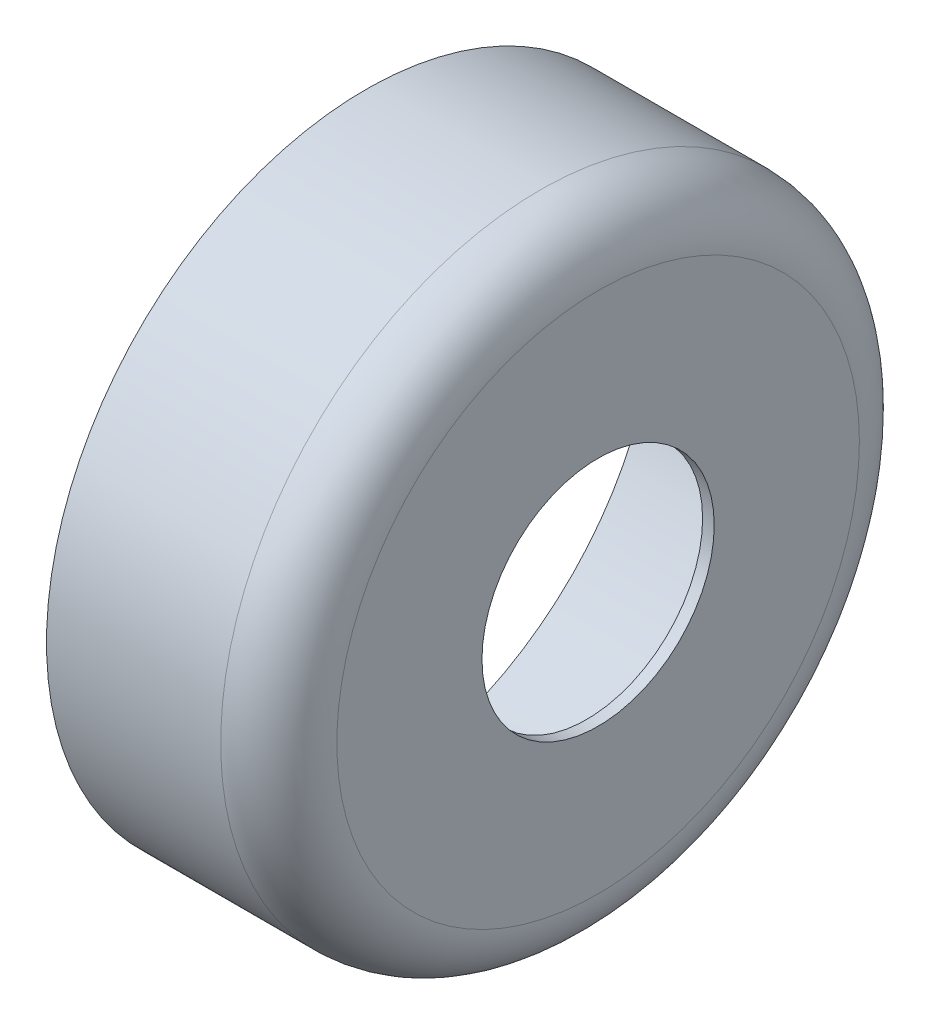
ISO-10303-21;
HEADER;
FILE_DESCRIPTION(('STEP AP214'),'2;1');
FILE_NAME('part.step','',(''),(''),'','','');
FILE_SCHEMA(('AUTOMOTIVE_DESIGN { 1 0 10303 214 1 1 1 1 }'));
ENDSEC;
DATA;
#1=APPLICATION_CONTEXT('core data for automotive mechanical design processes');
#2=APPLICATION_PROTOCOL_DEFINITION('international standard','automotive_design',2000,#1);
#3=PRODUCT_CONTEXT('',#1,'mechanical');
#4=PRODUCT('Part','Part','',(#3));
#5=PRODUCT_RELATED_PRODUCT_CATEGORY('part','',(#4));
#6=PRODUCT_DEFINITION_FORMATION('','',#4);
#7=PRODUCT_DEFINITION_CONTEXT('part definition',#1,'design');
#8=PRODUCT_DEFINITION('design','',#6,#7);
#9=PRODUCT_DEFINITION_SHAPE('','',#8);
#10=(LENGTH_UNIT() NAMED_UNIT(*) SI_UNIT(.MILLI.,.METRE.));
#11=(NAMED_UNIT(*) PLANE_ANGLE_UNIT() SI_UNIT($,.RADIAN.));
#12=(NAMED_UNIT(*) SI_UNIT($,.STERADIAN.) SOLID_ANGLE_UNIT());
#13=UNCERTAINTY_MEASURE_WITH_UNIT(LENGTH_MEASURE(1.E-05),#10,'distance_accuracy_value','');
#14=(GEOMETRIC_REPRESENTATION_CONTEXT(3) GLOBAL_UNCERTAINTY_ASSIGNED_CONTEXT((#13)) GLOBAL_UNIT_ASSIGNED_CONTEXT((#10,
#11,#12)) REPRESENTATION_CONTEXT('',''));
#15=CARTESIAN_POINT('',(0.,0.,0.));
#16=DIRECTION('',(0.,0.,1.));
#17=DIRECTION('',(1.,0.,0.));
#18=AXIS2_PLACEMENT_3D('',#15,#16,#17);
#19=CARTESIAN_POINT('',(40.,0.,0.));
#20=DIRECTION('',(-1.,0.,0.));
#21=DIRECTION('',(0.,0.,1.));
#22=AXIS2_PLACEMENT_3D('',#19,#20,#21);
#23=CYLINDRICAL_SURFACE('',#22,55.);
#24=CARTESIAN_POINT('',(30.,0.,0.));
#25=DIRECTION('',(1.,0.,0.));
#26=DIRECTION('',(0.,0.,-1.));
#27=AXIS2_PLACEMENT_3D('',#24,#25,#26);
#28=CIRCLE('',#27,55.);
#29=CARTESIAN_POINT('',(30.,0.,-55.));
#30=VERTEX_POINT('',#29);
#31=EDGE_CURVE('E10',#30,#30,#28,.F.);
#32=ORIENTED_EDGE('',*,*,#31,.T.);
#33=EDGE_LOOP('',(#32));
#34=FACE_BOUND('',#33,.T.);
#35=CARTESIAN_POINT('',(0.,0.,0.));
#36=DIRECTION('',(1.,0.,0.));
#37=DIRECTION('',(0.,0.,-1.));
#38=AXIS2_PLACEMENT_3D('',#35,#36,#37);
#39=CIRCLE('',#38,55.);
#40=CARTESIAN_POINT('',(0.,0.,-55.));
#41=VERTEX_POINT('',#40);
#42=EDGE_CURVE('E52',#41,#41,#39,.T.);
#43=ORIENTED_EDGE('',*,*,#42,.T.);
#44=EDGE_LOOP('',(#43));
#45=FACE_BOUND('',#44,.T.);
#46=ADVANCED_FACE('F39',(#34,#45),#23,.T.);
#47=CARTESIAN_POINT('',(40.,0.,0.));
#48=DIRECTION('',(1.,0.,0.));
#49=DIRECTION('',(0.,0.,-1.));
#50=AXIS2_PLACEMENT_3D('',#47,#48,#49);
#51=PLANE('',#50);
#52=CARTESIAN_POINT('',(40.,0.,0.));
#53=DIRECTION('',(1.,0.,0.));
#54=DIRECTION('',(0.,0.,-1.));
#55=AXIS2_PLACEMENT_3D('',#52,#53,#54);
#56=CIRCLE('',#55,45.);
#57=CARTESIAN_POINT('',(40.,0.,-45.));
#58=VERTEX_POINT('',#57);
#59=EDGE_CURVE('E47',#58,#58,#56,.T.);
#60=ORIENTED_EDGE('',*,*,#59,.T.);
#61=EDGE_LOOP('',(#60));
#62=FACE_BOUND('',#61,.T.);
#63=CARTESIAN_POINT('',(40.,0.,0.));
#64=DIRECTION('',(1.,0.,0.));
#65=DIRECTION('',(0.,0.,-1.));
#66=AXIS2_PLACEMENT_3D('',#63,#64,#65);
#67=CIRCLE('',#66,20.);
#68=CARTESIAN_POINT('',(40.,0.,-20.));
#69=VERTEX_POINT('',#68);
#70=EDGE_CURVE('E64',#69,#69,#67,.T.);
#71=ORIENTED_EDGE('',*,*,#70,.F.);
#72=EDGE_LOOP('',(#71));
#73=FACE_BOUND('',#72,.T.);
#74=ADVANCED_FACE('F78',(#62,#73),#51,.T.);
#75=CARTESIAN_POINT('',(0.,0.,0.));
#76=DIRECTION('',(1.,0.,0.));
#77=DIRECTION('',(0.,0.,-1.));
#78=AXIS2_PLACEMENT_3D('',#75,#76,#77);
#79=PLANE('',#78);
#80=CARTESIAN_POINT('',(0.,0.,0.));
#81=DIRECTION('',(-1.,0.,0.));
#82=DIRECTION('',(0.,0.,1.));
#83=AXIS2_PLACEMENT_3D('',#80,#81,#82);
#84=CIRCLE('',#83,50.);
#85=CARTESIAN_POINT('',(0.,0.,50.));
#86=VERTEX_POINT('',#85);
#87=EDGE_CURVE('E63',#86,#86,#84,.T.);
#88=ORIENTED_EDGE('',*,*,#87,.F.);
#89=EDGE_LOOP('',(#88));
#90=FACE_BOUND('',#89,.T.);
#91=ORIENTED_EDGE('',*,*,#42,.F.);
#92=EDGE_LOOP('',(#91));
#93=FACE_BOUND('',#92,.T.);
#94=ADVANCED_FACE('F80',(#90,#93),#79,.F.);
#95=CARTESIAN_POINT('',(38.,0.,0.));
#96=DIRECTION('',(-1.,0.,0.));
#97=DIRECTION('',(0.,0.,1.));
#98=AXIS2_PLACEMENT_3D('',#95,#96,#97);
#99=CYLINDRICAL_SURFACE('',#98,50.);
#100=CARTESIAN_POINT('',(38.,0.,0.));
#101=DIRECTION('',(-1.,0.,0.));
#102=DIRECTION('',(0.,0.,1.));
#103=AXIS2_PLACEMENT_3D('',#100,#101,#102);
#104=CIRCLE('',#103,50.);
#105=CARTESIAN_POINT('',(38.,0.,50.));
#106=VERTEX_POINT('',#105);
#107=EDGE_CURVE('E57',#106,#106,#104,.T.);
#108=ORIENTED_EDGE('',*,*,#107,.F.);
#109=EDGE_LOOP('',(#108));
#110=FACE_BOUND('',#109,.T.);
#111=ORIENTED_EDGE('',*,*,#87,.T.);
#112=EDGE_LOOP('',(#111));
#113=FACE_BOUND('',#112,.T.);
#114=ADVANCED_FACE('F86',(#110,#113),#99,.F.);
#115=CARTESIAN_POINT('',(38.,0.,0.));
#116=DIRECTION('',(-1.,0.,0.));
#117=DIRECTION('',(0.,0.,1.));
#118=AXIS2_PLACEMENT_3D('',#115,#116,#117);
#119=PLANE('',#118);
#120=CARTESIAN_POINT('',(38.,0.,0.));
#121=DIRECTION('',(-1.,0.,0.));
#122=DIRECTION('',(0.,0.,1.));
#123=AXIS2_PLACEMENT_3D('',#120,#121,#122);
#124=CIRCLE('',#123,20.);
#125=CARTESIAN_POINT('',(38.,0.,20.));
#126=VERTEX_POINT('',#125);
#127=EDGE_CURVE('E60',#126,#126,#124,.T.);
#128=ORIENTED_EDGE('',*,*,#127,.F.);
#129=EDGE_LOOP('',(#128));
#130=FACE_BOUND('',#129,.T.);
#131=ORIENTED_EDGE('',*,*,#107,.T.);
#132=EDGE_LOOP('',(#131));
#133=FACE_BOUND('',#132,.T.);
#134=ADVANCED_FACE('F92',(#130,#133),#119,.T.);
#135=CARTESIAN_POINT('',(2.,0.,0.));
#136=DIRECTION('',(1.,0.,0.));
#137=DIRECTION('',(0.,0.,-1.));
#138=AXIS2_PLACEMENT_3D('',#135,#136,#137);
#139=CYLINDRICAL_SURFACE('',#138,20.);
#140=ORIENTED_EDGE('',*,*,#127,.T.);
#141=EDGE_LOOP('',(#140));
#142=FACE_BOUND('',#141,.T.);
#143=ORIENTED_EDGE('',*,*,#70,.T.);
#144=EDGE_LOOP('',(#143));
#145=FACE_BOUND('',#144,.T.);
#146=ADVANCED_FACE('F76',(#142,#145),#139,.F.);
#147=CARTESIAN_POINT('',(30.,0.,0.));
#148=DIRECTION('',(1.,0.,0.));
#149=DIRECTION('',(0.,0.,-1.));
#150=AXIS2_PLACEMENT_3D('',#147,#148,#149);
#151=TOROIDAL_SURFACE('',#150,45.,10.);
#152=ORIENTED_EDGE('',*,*,#31,.F.);
#153=EDGE_LOOP('',(#152));
#154=FACE_BOUND('',#153,.T.);
#155=ORIENTED_EDGE('',*,*,#59,.F.);
#156=EDGE_LOOP('',(#155));
#157=FACE_BOUND('',#156,.T.);
#158=ADVANCED_FACE('F41',(#154,#157),#151,.T.);
#159=CLOSED_SHELL('',(#46,#74,#94,#114,#134,#146,#158));
#160=MANIFOLD_SOLID_BREP('B2',#159);
#161=ADVANCED_BREP_SHAPE_REPRESENTATION('',(#18,#160),#14);
#162=SHAPE_DEFINITION_REPRESENTATION(#9,#161);
ENDSEC;
END-ISO-10303-21;
